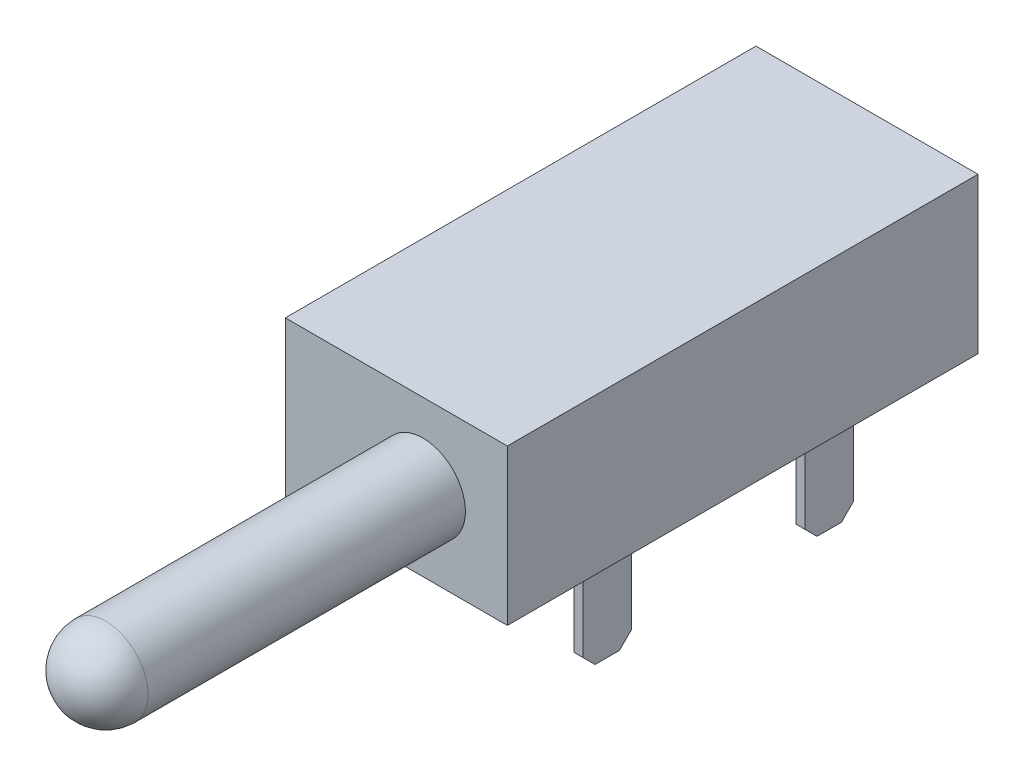
ISO-10303-21;
HEADER;
FILE_DESCRIPTION(('STEP AP214'),'2;1');
FILE_NAME('part.step','',(''),(''),'','','');
FILE_SCHEMA(('AUTOMOTIVE_DESIGN { 1 0 10303 214 1 1 1 1 }'));
ENDSEC;
DATA;
#1=APPLICATION_CONTEXT('core data for automotive mechanical design processes');
#2=APPLICATION_PROTOCOL_DEFINITION('international standard','automotive_design',2000,#1);
#3=PRODUCT_CONTEXT('',#1,'mechanical');
#4=PRODUCT('Part','Part','',(#3));
#5=PRODUCT_RELATED_PRODUCT_CATEGORY('part','',(#4));
#6=PRODUCT_DEFINITION_FORMATION('','',#4);
#7=PRODUCT_DEFINITION_CONTEXT('part definition',#1,'design');
#8=PRODUCT_DEFINITION('design','',#6,#7);
#9=PRODUCT_DEFINITION_SHAPE('','',#8);
#10=(LENGTH_UNIT() NAMED_UNIT(*) SI_UNIT(.MILLI.,.METRE.));
#11=(NAMED_UNIT(*) PLANE_ANGLE_UNIT() SI_UNIT($,.RADIAN.));
#12=(NAMED_UNIT(*) SI_UNIT($,.STERADIAN.) SOLID_ANGLE_UNIT());
#13=UNCERTAINTY_MEASURE_WITH_UNIT(LENGTH_MEASURE(1.E-05),#10,'distance_accuracy_value','');
#14=(GEOMETRIC_REPRESENTATION_CONTEXT(3) GLOBAL_UNCERTAINTY_ASSIGNED_CONTEXT((#13)) GLOBAL_UNIT_ASSIGNED_CONTEXT((#10,
#11,#12)) REPRESENTATION_CONTEXT('',''));
#15=CARTESIAN_POINT('',(0.,0.,0.));
#16=DIRECTION('',(0.,0.,1.));
#17=DIRECTION('',(1.,0.,0.));
#18=AXIS2_PLACEMENT_3D('',#15,#16,#17);
#19=CARTESIAN_POINT('',(-7.874,-4.445,-26.924));
#20=DIRECTION('',(0.,-1.,0.));
#21=DIRECTION('',(0.,0.,-1.));
#22=AXIS2_PLACEMENT_3D('',#19,#20,#21);
#23=PLANE('',#22);
#24=DIRECTION('',(1.,0.,0.));
#25=VECTOR('',#24,1.);
#26=CARTESIAN_POINT('',(-7.874,-4.445,0.));
#27=LINE('',#26,#25);
#28=CARTESIAN_POINT('',(-7.874,-4.445,0.));
#29=VERTEX_POINT('',#28);
#30=CARTESIAN_POINT('',(4.826,-4.445,0.));
#31=VERTEX_POINT('',#30);
#32=EDGE_CURVE('E278',#29,#31,#27,.T.);
#33=ORIENTED_EDGE('',*,*,#32,.F.);
#34=DIRECTION('',(0.,0.,1.));
#35=VECTOR('',#34,1.);
#36=CARTESIAN_POINT('',(-7.874,-4.445,-26.924));
#37=LINE('',#36,#35);
#38=CARTESIAN_POINT('',(-7.874,-4.445,-26.924));
#39=VERTEX_POINT('',#38);
#40=EDGE_CURVE('E286',#39,#29,#37,.T.);
#41=ORIENTED_EDGE('',*,*,#40,.F.);
#42=DIRECTION('',(1.,0.,0.));
#43=VECTOR('',#42,1.);
#44=CARTESIAN_POINT('',(-7.874,-4.445,-26.924));
#45=LINE('',#44,#43);
#46=CARTESIAN_POINT('',(4.826,-4.445,-26.924));
#47=VERTEX_POINT('',#46);
#48=EDGE_CURVE('E283',#39,#47,#45,.T.);
#49=ORIENTED_EDGE('',*,*,#48,.T.);
#50=DIRECTION('',(0.,0.,1.));
#51=VECTOR('',#50,1.);
#52=CARTESIAN_POINT('',(4.826,-4.445,-26.924));
#53=LINE('',#52,#51);
#54=EDGE_CURVE('E298',#47,#31,#53,.T.);
#55=ORIENTED_EDGE('',*,*,#54,.T.);
#56=EDGE_LOOP('',(#33,#41,#49,#55));
#57=FACE_BOUND('',#56,.T.);
#58=DIRECTION('',(1.,0.,0.));
#59=VECTOR('',#58,1.);
#60=CARTESIAN_POINT('',(-4.699,-4.445,-14.859));
#61=LINE('',#60,#59);
#62=CARTESIAN_POINT('',(-5.207,-4.445,-14.859));
#63=VERTEX_POINT('',#62);
#64=CARTESIAN_POINT('',(-4.699,-4.445,-14.859));
#65=VERTEX_POINT('',#64);
#66=EDGE_CURVE('E258',#63,#65,#61,.T.);
#67=ORIENTED_EDGE('',*,*,#66,.F.);
#68=DIRECTION('',(0.,0.,-1.));
#69=VECTOR('',#68,1.);
#70=CARTESIAN_POINT('',(-5.207,-4.445,-14.859));
#71=LINE('',#70,#69);
#72=CARTESIAN_POINT('',(-5.207,-4.445,-12.065));
#73=VERTEX_POINT('',#72);
#74=EDGE_CURVE('E247',#73,#63,#71,.T.);
#75=ORIENTED_EDGE('',*,*,#74,.F.);
#76=DIRECTION('',(-1.,0.,0.));
#77=VECTOR('',#76,1.);
#78=CARTESIAN_POINT('',(-4.699,-4.445,-12.065));
#79=LINE('',#78,#77);
#80=CARTESIAN_POINT('',(-4.699,-4.445,-12.065));
#81=VERTEX_POINT('',#80);
#82=EDGE_CURVE('E252',#81,#73,#79,.T.);
#83=ORIENTED_EDGE('',*,*,#82,.F.);
#84=DIRECTION('',(0.,0.,1.));
#85=VECTOR('',#84,1.);
#86=CARTESIAN_POINT('',(-4.699,-4.445,-14.859));
#87=LINE('',#86,#85);
#88=EDGE_CURVE('E261',#65,#81,#87,.T.);
#89=ORIENTED_EDGE('',*,*,#88,.F.);
#90=EDGE_LOOP('',(#67,#75,#83,#89));
#91=FACE_BOUND('',#90,.T.);
#92=DIRECTION('',(-1.,0.,0.));
#93=VECTOR('',#92,1.);
#94=CARTESIAN_POINT('',(1.651,-4.445,-19.685));
#95=LINE('',#94,#93);
#96=CARTESIAN_POINT('',(2.159,-4.445,-19.685));
#97=VERTEX_POINT('',#96);
#98=CARTESIAN_POINT('',(1.651,-4.445,-19.685));
#99=VERTEX_POINT('',#98);
#100=EDGE_CURVE('E232',#97,#99,#95,.T.);
#101=ORIENTED_EDGE('',*,*,#100,.F.);
#102=DIRECTION('',(0.,0.,1.));
#103=VECTOR('',#102,1.);
#104=CARTESIAN_POINT('',(2.159,-4.445,-19.685));
#105=LINE('',#104,#103);
#106=CARTESIAN_POINT('',(2.159,-4.445,-22.479));
#107=VERTEX_POINT('',#106);
#108=EDGE_CURVE('E195',#107,#97,#105,.T.);
#109=ORIENTED_EDGE('',*,*,#108,.F.);
#110=DIRECTION('',(1.,0.,0.));
#111=VECTOR('',#110,1.);
#112=CARTESIAN_POINT('',(1.651,-4.445,-22.479));
#113=LINE('',#112,#111);
#114=CARTESIAN_POINT('',(1.651,-4.445,-22.479));
#115=VERTEX_POINT('',#114);
#116=EDGE_CURVE('E226',#115,#107,#113,.T.);
#117=ORIENTED_EDGE('',*,*,#116,.F.);
#118=DIRECTION('',(0.,0.,-1.));
#119=VECTOR('',#118,1.);
#120=CARTESIAN_POINT('',(1.651,-4.445,-19.685));
#121=LINE('',#120,#119);
#122=EDGE_CURVE('E235',#99,#115,#121,.T.);
#123=ORIENTED_EDGE('',*,*,#122,.F.);
#124=EDGE_LOOP('',(#101,#109,#117,#123));
#125=FACE_BOUND('',#124,.T.);
#126=DIRECTION('',(1.,0.,0.));
#127=VECTOR('',#126,1.);
#128=CARTESIAN_POINT('',(2.159,-4.445,-9.779));
#129=LINE('',#128,#127);
#130=CARTESIAN_POINT('',(1.651,-4.445,-9.779));
#131=VERTEX_POINT('',#130);
#132=CARTESIAN_POINT('',(2.159,-4.445,-9.779));
#133=VERTEX_POINT('',#132);
#134=EDGE_CURVE('E189',#131,#133,#129,.T.);
#135=ORIENTED_EDGE('',*,*,#134,.F.);
#136=DIRECTION('',(0.,0.,-1.));
#137=VECTOR('',#136,1.);
#138=CARTESIAN_POINT('',(1.651,-4.445,-9.779));
#139=LINE('',#138,#137);
#140=CARTESIAN_POINT('',(1.651,-4.445,-6.985));
#141=VERTEX_POINT('',#140);
#142=EDGE_CURVE('E199',#141,#131,#139,.T.);
#143=ORIENTED_EDGE('',*,*,#142,.F.);
#144=DIRECTION('',(-1.,0.,0.));
#145=VECTOR('',#144,1.);
#146=CARTESIAN_POINT('',(2.159,-4.445,-6.985));
#147=LINE('',#146,#145);
#148=CARTESIAN_POINT('',(2.159,-4.445,-6.985));
#149=VERTEX_POINT('',#148);
#150=EDGE_CURVE('E211',#149,#141,#147,.T.);
#151=ORIENTED_EDGE('',*,*,#150,.F.);
#152=DIRECTION('',(0.,0.,1.));
#153=VECTOR('',#152,1.);
#154=CARTESIAN_POINT('',(2.159,-4.445,-9.779));
#155=LINE('',#154,#153);
#156=EDGE_CURVE('E209',#133,#149,#155,.T.);
#157=ORIENTED_EDGE('',*,*,#156,.F.);
#158=EDGE_LOOP('',(#135,#143,#151,#157));
#159=FACE_BOUND('',#158,.T.);
#160=ADVANCED_FACE('F35',(#57,#91,#125,#159),#23,.T.);
#161=CARTESIAN_POINT('',(-7.874,-4.445,-26.924));
#162=DIRECTION('',(1.,0.,0.));
#163=DIRECTION('',(0.,0.,-1.));
#164=AXIS2_PLACEMENT_3D('',#161,#162,#163);
#165=PLANE('',#164);
#166=DIRECTION('',(0.,1.,0.));
#167=VECTOR('',#166,1.);
#168=CARTESIAN_POINT('',(-7.874,-4.445,0.));
#169=LINE('',#168,#167);
#170=CARTESIAN_POINT('',(-7.874,4.445,0.));
#171=VERTEX_POINT('',#170);
#172=EDGE_CURVE('E273',#29,#171,#169,.T.);
#173=ORIENTED_EDGE('',*,*,#172,.T.);
#174=DIRECTION('',(0.,0.,1.));
#175=VECTOR('',#174,1.);
#176=CARTESIAN_POINT('',(-7.874,4.445,-26.924));
#177=LINE('',#176,#175);
#178=CARTESIAN_POINT('',(-7.874,4.445,-26.924));
#179=VERTEX_POINT('',#178);
#180=EDGE_CURVE('E302',#179,#171,#177,.T.);
#181=ORIENTED_EDGE('',*,*,#180,.F.);
#182=DIRECTION('',(0.,1.,0.));
#183=VECTOR('',#182,1.);
#184=CARTESIAN_POINT('',(-7.874,-4.445,-26.924));
#185=LINE('',#184,#183);
#186=EDGE_CURVE('E274',#39,#179,#185,.T.);
#187=ORIENTED_EDGE('',*,*,#186,.F.);
#188=ORIENTED_EDGE('',*,*,#40,.T.);
#189=EDGE_LOOP('',(#173,#181,#187,#188));
#190=FACE_BOUND('',#189,.T.);
#191=ADVANCED_FACE('F391',(#190),#165,.F.);
#192=CARTESIAN_POINT('',(-7.874,4.445,-26.924));
#193=DIRECTION('',(0.,-1.,0.));
#194=DIRECTION('',(0.,0.,-1.));
#195=AXIS2_PLACEMENT_3D('',#192,#193,#194);
#196=PLANE('',#195);
#197=DIRECTION('',(1.,0.,0.));
#198=VECTOR('',#197,1.);
#199=CARTESIAN_POINT('',(-7.874,4.445,0.));
#200=LINE('',#199,#198);
#201=CARTESIAN_POINT('',(4.826,4.445,0.));
#202=VERTEX_POINT('',#201);
#203=EDGE_CURVE('E289',#171,#202,#200,.T.);
#204=ORIENTED_EDGE('',*,*,#203,.T.);
#205=DIRECTION('',(0.,0.,1.));
#206=VECTOR('',#205,1.);
#207=CARTESIAN_POINT('',(4.826,4.445,-26.924));
#208=LINE('',#207,#206);
#209=CARTESIAN_POINT('',(4.826,4.445,-26.924));
#210=VERTEX_POINT('',#209);
#211=EDGE_CURVE('E300',#210,#202,#208,.T.);
#212=ORIENTED_EDGE('',*,*,#211,.F.);
#213=DIRECTION('',(1.,0.,0.));
#214=VECTOR('',#213,1.);
#215=CARTESIAN_POINT('',(-7.874,4.445,-26.924));
#216=LINE('',#215,#214);
#217=EDGE_CURVE('E277',#179,#210,#216,.T.);
#218=ORIENTED_EDGE('',*,*,#217,.F.);
#219=ORIENTED_EDGE('',*,*,#180,.T.);
#220=EDGE_LOOP('',(#204,#212,#218,#219));
#221=FACE_BOUND('',#220,.T.);
#222=ADVANCED_FACE('F397',(#221),#196,.F.);
#223=CARTESIAN_POINT('',(4.826,-4.445,-26.924));
#224=DIRECTION('',(1.,0.,0.));
#225=DIRECTION('',(0.,0.,-1.));
#226=AXIS2_PLACEMENT_3D('',#223,#224,#225);
#227=PLANE('',#226);
#228=DIRECTION('',(0.,1.,0.));
#229=VECTOR('',#228,1.);
#230=CARTESIAN_POINT('',(4.826,-4.445,0.));
#231=LINE('',#230,#229);
#232=EDGE_CURVE('E292',#31,#202,#231,.T.);
#233=ORIENTED_EDGE('',*,*,#232,.F.);
#234=ORIENTED_EDGE('',*,*,#54,.F.);
#235=DIRECTION('',(0.,1.,0.));
#236=VECTOR('',#235,1.);
#237=CARTESIAN_POINT('',(4.826,-4.445,-26.924));
#238=LINE('',#237,#236);
#239=EDGE_CURVE('E280',#47,#210,#238,.T.);
#240=ORIENTED_EDGE('',*,*,#239,.T.);
#241=ORIENTED_EDGE('',*,*,#211,.T.);
#242=EDGE_LOOP('',(#233,#234,#240,#241));
#243=FACE_BOUND('',#242,.T.);
#244=ADVANCED_FACE('F405',(#243),#227,.T.);
#245=CARTESIAN_POINT('',(0.,0.,-26.924));
#246=DIRECTION('',(0.,0.,-1.));
#247=DIRECTION('',(-1.,0.,0.));
#248=AXIS2_PLACEMENT_3D('',#245,#246,#247);
#249=PLANE('',#248);
#250=ORIENTED_EDGE('',*,*,#186,.T.);
#251=ORIENTED_EDGE('',*,*,#217,.T.);
#252=ORIENTED_EDGE('',*,*,#239,.F.);
#253=ORIENTED_EDGE('',*,*,#48,.F.);
#254=EDGE_LOOP('',(#250,#251,#252,#253));
#255=FACE_BOUND('',#254,.T.);
#256=ADVANCED_FACE('F408',(#255),#249,.T.);
#257=CARTESIAN_POINT('',(0.,0.,0.));
#258=DIRECTION('',(0.,0.,-1.));
#259=DIRECTION('',(-1.,0.,0.));
#260=AXIS2_PLACEMENT_3D('',#257,#258,#259);
#261=PLANE('',#260);
#262=CARTESIAN_POINT('',(0.,0.,0.));
#263=DIRECTION('',(0.,0.,-1.));
#264=DIRECTION('',(-1.,0.,0.));
#265=AXIS2_PLACEMENT_3D('',#262,#263,#264);
#266=CIRCLE('',#265,2.4257);
#267=CARTESIAN_POINT('',(-2.4257,0.,0.));
#268=VERTEX_POINT('',#267);
#269=EDGE_CURVE('E305',#268,#268,#266,.F.);
#270=ORIENTED_EDGE('',*,*,#269,.F.);
#271=EDGE_LOOP('',(#270));
#272=FACE_BOUND('',#271,.T.);
#273=ORIENTED_EDGE('',*,*,#172,.F.);
#274=ORIENTED_EDGE('',*,*,#32,.T.);
#275=ORIENTED_EDGE('',*,*,#232,.T.);
#276=ORIENTED_EDGE('',*,*,#203,.F.);
#277=EDGE_LOOP('',(#273,#274,#275,#276));
#278=FACE_BOUND('',#277,.T.);
#279=ADVANCED_FACE('F403',(#272,#278),#261,.F.);
#280=CARTESIAN_POINT('',(0.,0.,20.574));
#281=DIRECTION('',(0.,0.,-1.));
#282=DIRECTION('',(-1.,0.,0.));
#283=AXIS2_PLACEMENT_3D('',#280,#281,#282);
#284=CYLINDRICAL_SURFACE('',#283,2.4257);
#285=CARTESIAN_POINT('',(0.,0.,18.1483));
#286=DIRECTION('',(0.,0.,-1.));
#287=DIRECTION('',(-1.,0.,0.));
#288=AXIS2_PLACEMENT_3D('',#285,#286,#287);
#289=CIRCLE('',#288,2.4257);
#290=CARTESIAN_POINT('',(-2.4257,0.,18.1483));
#291=VERTEX_POINT('',#290);
#292=EDGE_CURVE('E308',#291,#291,#289,.T.);
#293=ORIENTED_EDGE('',*,*,#292,.T.);
#294=EDGE_LOOP('',(#293));
#295=FACE_BOUND('',#294,.T.);
#296=ORIENTED_EDGE('',*,*,#269,.T.);
#297=EDGE_LOOP('',(#296));
#298=FACE_BOUND('',#297,.T.);
#299=ADVANCED_FACE('F416',(#295,#298),#284,.T.);
#300=CARTESIAN_POINT('',(0.,0.,18.1483));
#301=DIRECTION('',(0.,0.,1.));
#302=DIRECTION('',(1.,0.,0.));
#303=AXIS2_PLACEMENT_3D('',#300,#301,#302);
#304=SPHERICAL_SURFACE('',#303,2.4257);
#305=ORIENTED_EDGE('',*,*,#292,.F.);
#306=EDGE_LOOP('',(#305));
#307=FACE_BOUND('',#306,.T.);
#308=ADVANCED_FACE('F413',(#307),#304,.T.);
#309=CARTESIAN_POINT('',(-5.207,-11.557,-14.859));
#310=DIRECTION('',(1.,0.,0.));
#311=DIRECTION('',(0.,0.,-1.));
#312=AXIS2_PLACEMENT_3D('',#309,#310,#311);
#313=PLANE('',#312);
#314=DIRECTION('',(0.,1.,0.));
#315=VECTOR('',#314,1.);
#316=CARTESIAN_POINT('',(-5.207,-11.557,-14.859));
#317=LINE('',#316,#315);
#318=CARTESIAN_POINT('',(-5.207,-10.8585,-14.859));
#319=VERTEX_POINT('',#318);
#320=EDGE_CURVE('E271',#319,#63,#317,.T.);
#321=ORIENTED_EDGE('',*,*,#320,.F.);
#322=DIRECTION('',(0.,-0.707106781186551,0.707106781186544));
#323=VECTOR('',#322,1.);
#324=CARTESIAN_POINT('',(-5.207,-11.557,-14.1605));
#325=LINE('',#324,#323);
#326=CARTESIAN_POINT('',(-5.207,-11.557,-14.1605));
#327=VERTEX_POINT('',#326);
#328=EDGE_CURVE('E43',#319,#327,#325,.T.);
#329=ORIENTED_EDGE('',*,*,#328,.T.);
#330=DIRECTION('',(0.,0.,-1.));
#331=VECTOR('',#330,1.);
#332=CARTESIAN_POINT('',(-5.207,-11.557,-14.859));
#333=LINE('',#332,#331);
#334=CARTESIAN_POINT('',(-5.207,-11.557,-12.7635));
#335=VERTEX_POINT('',#334);
#336=EDGE_CURVE('E248',#335,#327,#333,.T.);
#337=ORIENTED_EDGE('',*,*,#336,.F.);
#338=DIRECTION('',(0.,0.707106781186551,0.707106781186544));
#339=VECTOR('',#338,1.);
#340=CARTESIAN_POINT('',(-5.207,-11.557,-12.7635));
#341=LINE('',#340,#339);
#342=CARTESIAN_POINT('',(-5.207,-10.8585,-12.065));
#343=VERTEX_POINT('',#342);
#344=EDGE_CURVE('E50',#335,#343,#341,.T.);
#345=ORIENTED_EDGE('',*,*,#344,.T.);
#346=DIRECTION('',(0.,1.,0.));
#347=VECTOR('',#346,1.);
#348=CARTESIAN_POINT('',(-5.207,-11.557,-12.065));
#349=LINE('',#348,#347);
#350=EDGE_CURVE('E255',#343,#73,#349,.T.);
#351=ORIENTED_EDGE('',*,*,#350,.T.);
#352=ORIENTED_EDGE('',*,*,#74,.T.);
#353=EDGE_LOOP('',(#321,#329,#337,#345,#351,#352));
#354=FACE_BOUND('',#353,.T.);
#355=ADVANCED_FACE('F358',(#354),#313,.F.);
#356=CARTESIAN_POINT('',(-4.699,-11.557,-14.859));
#357=DIRECTION('',(0.,0.,1.));
#358=DIRECTION('',(1.,0.,0.));
#359=AXIS2_PLACEMENT_3D('',#356,#357,#358);
#360=PLANE('',#359);
#361=DIRECTION('',(0.,1.,0.));
#362=VECTOR('',#361,1.);
#363=CARTESIAN_POINT('',(-4.699,-11.557,-14.859));
#364=LINE('',#363,#362);
#365=CARTESIAN_POINT('',(-4.699,-10.8585,-14.859));
#366=VERTEX_POINT('',#365);
#367=EDGE_CURVE('E269',#366,#65,#364,.T.);
#368=ORIENTED_EDGE('',*,*,#367,.F.);
#369=DIRECTION('',(-1.,0.,0.));
#370=VECTOR('',#369,1.);
#371=CARTESIAN_POINT('',(-5.207,-10.8585,-14.859));
#372=LINE('',#371,#370);
#373=EDGE_CURVE('E58',#366,#319,#372,.T.);
#374=ORIENTED_EDGE('',*,*,#373,.T.);
#375=ORIENTED_EDGE('',*,*,#320,.T.);
#376=ORIENTED_EDGE('',*,*,#66,.T.);
#377=EDGE_LOOP('',(#368,#374,#375,#376));
#378=FACE_BOUND('',#377,.T.);
#379=ADVANCED_FACE('F368',(#378),#360,.F.);
#380=CARTESIAN_POINT('',(-4.699,-11.557,-14.859));
#381=DIRECTION('',(-1.,0.,0.));
#382=DIRECTION('',(0.,0.,1.));
#383=AXIS2_PLACEMENT_3D('',#380,#381,#382);
#384=PLANE('',#383);
#385=DIRECTION('',(0.,0.,1.));
#386=VECTOR('',#385,1.);
#387=CARTESIAN_POINT('',(-4.699,-11.557,-14.859));
#388=LINE('',#387,#386);
#389=CARTESIAN_POINT('',(-4.699,-11.557,-14.1605));
#390=VERTEX_POINT('',#389);
#391=CARTESIAN_POINT('',(-4.699,-11.557,-12.7635));
#392=VERTEX_POINT('',#391);
#393=EDGE_CURVE('E251',#390,#392,#388,.T.);
#394=ORIENTED_EDGE('',*,*,#393,.F.);
#395=DIRECTION('',(0.,0.707106781186551,-0.707106781186544));
#396=VECTOR('',#395,1.);
#397=CARTESIAN_POINT('',(-4.699,-11.557,-14.1605));
#398=LINE('',#397,#396);
#399=EDGE_CURVE('E354',#390,#366,#398,.T.);
#400=ORIENTED_EDGE('',*,*,#399,.T.);
#401=ORIENTED_EDGE('',*,*,#367,.T.);
#402=ORIENTED_EDGE('',*,*,#88,.T.);
#403=DIRECTION('',(0.,1.,0.));
#404=VECTOR('',#403,1.);
#405=CARTESIAN_POINT('',(-4.699,-11.557,-12.065));
#406=LINE('',#405,#404);
#407=CARTESIAN_POINT('',(-4.699,-10.8585,-12.065));
#408=VERTEX_POINT('',#407);
#409=EDGE_CURVE('E267',#408,#81,#406,.T.);
#410=ORIENTED_EDGE('',*,*,#409,.F.);
#411=DIRECTION('',(0.,-0.707106781186551,-0.707106781186544));
#412=VECTOR('',#411,1.);
#413=CARTESIAN_POINT('',(-4.699,-11.557,-12.7635));
#414=LINE('',#413,#412);
#415=EDGE_CURVE('E352',#408,#392,#414,.T.);
#416=ORIENTED_EDGE('',*,*,#415,.T.);
#417=EDGE_LOOP('',(#394,#400,#401,#402,#410,#416));
#418=FACE_BOUND('',#417,.T.);
#419=ADVANCED_FACE('F367',(#418),#384,.F.);
#420=CARTESIAN_POINT('',(-4.699,-11.557,-12.065));
#421=DIRECTION('',(0.,0.,-1.));
#422=DIRECTION('',(-1.,0.,0.));
#423=AXIS2_PLACEMENT_3D('',#420,#421,#422);
#424=PLANE('',#423);
#425=ORIENTED_EDGE('',*,*,#350,.F.);
#426=DIRECTION('',(1.,0.,0.));
#427=VECTOR('',#426,1.);
#428=CARTESIAN_POINT('',(-4.699,-10.8585,-12.065));
#429=LINE('',#428,#427);
#430=EDGE_CURVE('E11',#343,#408,#429,.T.);
#431=ORIENTED_EDGE('',*,*,#430,.T.);
#432=ORIENTED_EDGE('',*,*,#409,.T.);
#433=ORIENTED_EDGE('',*,*,#82,.T.);
#434=EDGE_LOOP('',(#425,#431,#432,#433));
#435=FACE_BOUND('',#434,.T.);
#436=ADVANCED_FACE('F380',(#435),#424,.F.);
#437=CARTESIAN_POINT('',(0.,-11.557,0.));
#438=DIRECTION('',(0.,-1.,0.));
#439=DIRECTION('',(0.,0.,-1.));
#440=AXIS2_PLACEMENT_3D('',#437,#438,#439);
#441=PLANE('',#440);
#442=ORIENTED_EDGE('',*,*,#336,.T.);
#443=DIRECTION('',(1.,0.,0.));
#444=VECTOR('',#443,1.);
#445=CARTESIAN_POINT('',(-4.699,-11.557,-14.1605));
#446=LINE('',#445,#444);
#447=EDGE_CURVE('E349',#327,#390,#446,.T.);
#448=ORIENTED_EDGE('',*,*,#447,.T.);
#449=ORIENTED_EDGE('',*,*,#393,.T.);
#450=DIRECTION('',(-1.,0.,0.));
#451=VECTOR('',#450,1.);
#452=CARTESIAN_POINT('',(-5.207,-11.557,-12.7635));
#453=LINE('',#452,#451);
#454=EDGE_CURVE('E346',#392,#335,#453,.T.);
#455=ORIENTED_EDGE('',*,*,#454,.T.);
#456=EDGE_LOOP('',(#442,#448,#449,#455));
#457=FACE_BOUND('',#456,.T.);
#458=ADVANCED_FACE('F362',(#457),#441,.T.);
#459=CARTESIAN_POINT('',(2.159,-11.557,-19.685));
#460=DIRECTION('',(-1.,0.,0.));
#461=DIRECTION('',(0.,0.,1.));
#462=AXIS2_PLACEMENT_3D('',#459,#460,#461);
#463=PLANE('',#462);
#464=DIRECTION('',(0.,0.,1.));
#465=VECTOR('',#464,1.);
#466=CARTESIAN_POINT('',(2.159,-11.557,-19.685));
#467=LINE('',#466,#465);
#468=CARTESIAN_POINT('',(2.159,-11.557,-21.7805));
#469=VERTEX_POINT('',#468);
#470=CARTESIAN_POINT('',(2.159,-11.557,-20.3835));
#471=VERTEX_POINT('',#470);
#472=EDGE_CURVE('E222',#469,#471,#467,.T.);
#473=ORIENTED_EDGE('',*,*,#472,.F.);
#474=DIRECTION('',(0.,0.707106781186548,-0.707106781186548));
#475=VECTOR('',#474,1.);
#476=CARTESIAN_POINT('',(2.159,-11.557,-21.7805));
#477=LINE('',#476,#475);
#478=CARTESIAN_POINT('',(2.159,-10.8585,-22.479));
#479=VERTEX_POINT('',#478);
#480=EDGE_CURVE('E336',#469,#479,#477,.T.);
#481=ORIENTED_EDGE('',*,*,#480,.T.);
#482=DIRECTION('',(0.,1.,0.));
#483=VECTOR('',#482,1.);
#484=CARTESIAN_POINT('',(2.159,-11.557,-22.479));
#485=LINE('',#484,#483);
#486=EDGE_CURVE('E229',#479,#107,#485,.T.);
#487=ORIENTED_EDGE('',*,*,#486,.T.);
#488=ORIENTED_EDGE('',*,*,#108,.T.);
#489=DIRECTION('',(0.,1.,0.));
#490=VECTOR('',#489,1.);
#491=CARTESIAN_POINT('',(2.159,-11.557,-19.685));
#492=LINE('',#491,#490);
#493=CARTESIAN_POINT('',(2.159,-10.8585,-19.685));
#494=VERTEX_POINT('',#493);
#495=EDGE_CURVE('E245',#494,#97,#492,.T.);
#496=ORIENTED_EDGE('',*,*,#495,.F.);
#497=DIRECTION('',(0.,-0.707106781186548,-0.707106781186548));
#498=VECTOR('',#497,1.);
#499=CARTESIAN_POINT('',(2.159,-11.557,-20.3835));
#500=LINE('',#499,#498);
#501=EDGE_CURVE('E334',#494,#471,#500,.T.);
#502=ORIENTED_EDGE('',*,*,#501,.T.);
#503=EDGE_LOOP('',(#473,#481,#487,#488,#496,#502));
#504=FACE_BOUND('',#503,.T.);
#505=ADVANCED_FACE('F387',(#504),#463,.F.);
#506=CARTESIAN_POINT('',(1.651,-11.557,-19.685));
#507=DIRECTION('',(0.,0.,-1.));
#508=DIRECTION('',(-1.,0.,0.));
#509=AXIS2_PLACEMENT_3D('',#506,#507,#508);
#510=PLANE('',#509);
#511=DIRECTION('',(0.,1.,0.));
#512=VECTOR('',#511,1.);
#513=CARTESIAN_POINT('',(1.651,-11.557,-19.685));
#514=LINE('',#513,#512);
#515=CARTESIAN_POINT('',(1.651,-10.8585,-19.685));
#516=VERTEX_POINT('',#515);
#517=EDGE_CURVE('E243',#516,#99,#514,.T.);
#518=ORIENTED_EDGE('',*,*,#517,.F.);
#519=DIRECTION('',(1.,0.,0.));
#520=VECTOR('',#519,1.);
#521=CARTESIAN_POINT('',(2.159,-10.8585,-19.685));
#522=LINE('',#521,#520);
#523=EDGE_CURVE('E344',#516,#494,#522,.T.);
#524=ORIENTED_EDGE('',*,*,#523,.T.);
#525=ORIENTED_EDGE('',*,*,#495,.T.);
#526=ORIENTED_EDGE('',*,*,#100,.T.);
#527=EDGE_LOOP('',(#518,#524,#525,#526));
#528=FACE_BOUND('',#527,.T.);
#529=ADVANCED_FACE('F543',(#528),#510,.F.);
#530=CARTESIAN_POINT('',(1.651,-11.557,-19.685));
#531=DIRECTION('',(1.,0.,0.));
#532=DIRECTION('',(0.,0.,-1.));
#533=AXIS2_PLACEMENT_3D('',#530,#531,#532);
#534=PLANE('',#533);
#535=DIRECTION('',(0.,1.,0.));
#536=VECTOR('',#535,1.);
#537=CARTESIAN_POINT('',(1.651,-11.557,-22.479));
#538=LINE('',#537,#536);
#539=CARTESIAN_POINT('',(1.651,-10.8585,-22.479));
#540=VERTEX_POINT('',#539);
#541=EDGE_CURVE('E241',#540,#115,#538,.T.);
#542=ORIENTED_EDGE('',*,*,#541,.F.);
#543=DIRECTION('',(0.,-0.707106781186548,0.707106781186548));
#544=VECTOR('',#543,1.);
#545=CARTESIAN_POINT('',(1.651,-11.557,-21.7805));
#546=LINE('',#545,#544);
#547=CARTESIAN_POINT('',(1.651,-11.557,-21.7805));
#548=VERTEX_POINT('',#547);
#549=EDGE_CURVE('E342',#540,#548,#546,.T.);
#550=ORIENTED_EDGE('',*,*,#549,.T.);
#551=DIRECTION('',(0.,0.,-1.));
#552=VECTOR('',#551,1.);
#553=CARTESIAN_POINT('',(1.651,-11.557,-19.685));
#554=LINE('',#553,#552);
#555=CARTESIAN_POINT('',(1.651,-11.557,-20.3835));
#556=VERTEX_POINT('',#555);
#557=EDGE_CURVE('E225',#556,#548,#554,.T.);
#558=ORIENTED_EDGE('',*,*,#557,.F.);
#559=DIRECTION('',(0.,0.707106781186548,0.707106781186548));
#560=VECTOR('',#559,1.);
#561=CARTESIAN_POINT('',(1.651,-11.557,-20.3835));
#562=LINE('',#561,#560);
#563=EDGE_CURVE('E340',#556,#516,#562,.T.);
#564=ORIENTED_EDGE('',*,*,#563,.T.);
#565=ORIENTED_EDGE('',*,*,#517,.T.);
#566=ORIENTED_EDGE('',*,*,#122,.T.);
#567=EDGE_LOOP('',(#542,#550,#558,#564,#565,#566));
#568=FACE_BOUND('',#567,.T.);
#569=ADVANCED_FACE('F533',(#568),#534,.F.);
#570=CARTESIAN_POINT('',(1.651,-11.557,-22.479));
#571=DIRECTION('',(0.,0.,1.));
#572=DIRECTION('',(1.,0.,0.));
#573=AXIS2_PLACEMENT_3D('',#570,#571,#572);
#574=PLANE('',#573);
#575=ORIENTED_EDGE('',*,*,#486,.F.);
#576=DIRECTION('',(-1.,0.,0.));
#577=VECTOR('',#576,1.);
#578=CARTESIAN_POINT('',(1.651,-10.8585,-22.479));
#579=LINE('',#578,#577);
#580=EDGE_CURVE('E338',#479,#540,#579,.T.);
#581=ORIENTED_EDGE('',*,*,#580,.T.);
#582=ORIENTED_EDGE('',*,*,#541,.T.);
#583=ORIENTED_EDGE('',*,*,#116,.T.);
#584=EDGE_LOOP('',(#575,#581,#582,#583));
#585=FACE_BOUND('',#584,.T.);
#586=ADVANCED_FACE('F523',(#585),#574,.F.);
#587=CARTESIAN_POINT('',(0.,-11.557,0.));
#588=DIRECTION('',(0.,-1.,0.));
#589=DIRECTION('',(0.,0.,-1.));
#590=AXIS2_PLACEMENT_3D('',#587,#588,#589);
#591=PLANE('',#590);
#592=ORIENTED_EDGE('',*,*,#557,.T.);
#593=DIRECTION('',(1.,0.,0.));
#594=VECTOR('',#593,1.);
#595=CARTESIAN_POINT('',(2.159,-11.557,-21.7805));
#596=LINE('',#595,#594);
#597=EDGE_CURVE('E331',#548,#469,#596,.T.);
#598=ORIENTED_EDGE('',*,*,#597,.T.);
#599=ORIENTED_EDGE('',*,*,#472,.T.);
#600=DIRECTION('',(-1.,0.,0.));
#601=VECTOR('',#600,1.);
#602=CARTESIAN_POINT('',(1.651,-11.557,-20.3835));
#603=LINE('',#602,#601);
#604=EDGE_CURVE('E328',#471,#556,#603,.T.);
#605=ORIENTED_EDGE('',*,*,#604,.T.);
#606=EDGE_LOOP('',(#592,#598,#599,#605));
#607=FACE_BOUND('',#606,.T.);
#608=ADVANCED_FACE('F514',(#607),#591,.T.);
#609=CARTESIAN_POINT('',(1.651,-11.557,-9.779));
#610=DIRECTION('',(1.,0.,0.));
#611=DIRECTION('',(0.,0.,-1.));
#612=AXIS2_PLACEMENT_3D('',#609,#610,#611);
#613=PLANE('',#612);
#614=DIRECTION('',(0.,0.,-1.));
#615=VECTOR('',#614,1.);
#616=CARTESIAN_POINT('',(1.651,-11.557,-9.779));
#617=LINE('',#616,#615);
#618=CARTESIAN_POINT('',(1.651,-11.557,-7.6835));
#619=VERTEX_POINT('',#618);
#620=CARTESIAN_POINT('',(1.651,-11.557,-9.0805));
#621=VERTEX_POINT('',#620);
#622=EDGE_CURVE('E216',#619,#621,#617,.T.);
#623=ORIENTED_EDGE('',*,*,#622,.F.);
#624=DIRECTION('',(0.,0.707106781186548,0.707106781186547));
#625=VECTOR('',#624,1.);
#626=CARTESIAN_POINT('',(1.651,-11.557,-7.6835));
#627=LINE('',#626,#625);
#628=CARTESIAN_POINT('',(1.651,-10.8585,-6.985));
#629=VERTEX_POINT('',#628);
#630=EDGE_CURVE('E319',#619,#629,#627,.T.);
#631=ORIENTED_EDGE('',*,*,#630,.T.);
#632=DIRECTION('',(0.,1.,0.));
#633=VECTOR('',#632,1.);
#634=CARTESIAN_POINT('',(1.651,-11.557,-6.985));
#635=LINE('',#634,#633);
#636=EDGE_CURVE('E203',#629,#141,#635,.T.);
#637=ORIENTED_EDGE('',*,*,#636,.T.);
#638=ORIENTED_EDGE('',*,*,#142,.T.);
#639=DIRECTION('',(0.,1.,0.));
#640=VECTOR('',#639,1.);
#641=CARTESIAN_POINT('',(1.651,-11.557,-9.779));
#642=LINE('',#641,#640);
#643=CARTESIAN_POINT('',(1.651,-10.8585,-9.779));
#644=VERTEX_POINT('',#643);
#645=EDGE_CURVE('E184',#644,#131,#642,.T.);
#646=ORIENTED_EDGE('',*,*,#645,.F.);
#647=DIRECTION('',(0.,-0.707106781186551,0.707106781186544));
#648=VECTOR('',#647,1.);
#649=CARTESIAN_POINT('',(1.651,-11.557,-9.0805));
#650=LINE('',#649,#648);
#651=EDGE_CURVE('E317',#644,#621,#650,.T.);
#652=ORIENTED_EDGE('',*,*,#651,.T.);
#653=EDGE_LOOP('',(#623,#631,#637,#638,#646,#652));
#654=FACE_BOUND('',#653,.T.);
#655=ADVANCED_FACE('F201',(#654),#613,.F.);
#656=CARTESIAN_POINT('',(2.159,-11.557,-9.779));
#657=DIRECTION('',(0.,0.,1.));
#658=DIRECTION('',(1.,0.,0.));
#659=AXIS2_PLACEMENT_3D('',#656,#657,#658);
#660=PLANE('',#659);
#661=DIRECTION('',(0.,1.,0.));
#662=VECTOR('',#661,1.);
#663=CARTESIAN_POINT('',(2.159,-11.557,-9.779));
#664=LINE('',#663,#662);
#665=CARTESIAN_POINT('',(2.159,-10.8585,-9.779));
#666=VERTEX_POINT('',#665);
#667=EDGE_CURVE('E196',#666,#133,#664,.T.);
#668=ORIENTED_EDGE('',*,*,#667,.F.);
#669=DIRECTION('',(-1.,0.,0.));
#670=VECTOR('',#669,1.);
#671=CARTESIAN_POINT('',(1.651,-10.8585,-9.779));
#672=LINE('',#671,#670);
#673=EDGE_CURVE('E192',#666,#644,#672,.T.);
#674=ORIENTED_EDGE('',*,*,#673,.T.);
#675=ORIENTED_EDGE('',*,*,#645,.T.);
#676=ORIENTED_EDGE('',*,*,#134,.T.);
#677=EDGE_LOOP('',(#668,#674,#675,#676));
#678=FACE_BOUND('',#677,.T.);
#679=ADVANCED_FACE('F187',(#678),#660,.F.);
#680=CARTESIAN_POINT('',(2.159,-11.557,-9.779));
#681=DIRECTION('',(-1.,0.,0.));
#682=DIRECTION('',(0.,0.,1.));
#683=AXIS2_PLACEMENT_3D('',#680,#681,#682);
#684=PLANE('',#683);
#685=DIRECTION('',(0.,1.,0.));
#686=VECTOR('',#685,1.);
#687=CARTESIAN_POINT('',(2.159,-11.557,-6.985));
#688=LINE('',#687,#686);
#689=CARTESIAN_POINT('',(2.159,-10.8585,-6.985));
#690=VERTEX_POINT('',#689);
#691=EDGE_CURVE('E218',#690,#149,#688,.T.);
#692=ORIENTED_EDGE('',*,*,#691,.F.);
#693=DIRECTION('',(0.,-0.707106781186548,-0.707106781186547));
#694=VECTOR('',#693,1.);
#695=CARTESIAN_POINT('',(2.159,-11.557,-7.6835));
#696=LINE('',#695,#694);
#697=CARTESIAN_POINT('',(2.159,-11.557,-7.6835));
#698=VERTEX_POINT('',#697);
#699=EDGE_CURVE('E325',#690,#698,#696,.T.);
#700=ORIENTED_EDGE('',*,*,#699,.T.);
#701=DIRECTION('',(0.,0.,1.));
#702=VECTOR('',#701,1.);
#703=CARTESIAN_POINT('',(2.159,-11.557,-9.779));
#704=LINE('',#703,#702);
#705=CARTESIAN_POINT('',(2.159,-11.557,-9.0805));
#706=VERTEX_POINT('',#705);
#707=EDGE_CURVE('E219',#706,#698,#704,.T.);
#708=ORIENTED_EDGE('',*,*,#707,.F.);
#709=DIRECTION('',(0.,0.707106781186551,-0.707106781186544));
#710=VECTOR('',#709,1.);
#711=CARTESIAN_POINT('',(2.159,-11.557,-9.0805));
#712=LINE('',#711,#710);
#713=EDGE_CURVE('E323',#706,#666,#712,.T.);
#714=ORIENTED_EDGE('',*,*,#713,.T.);
#715=ORIENTED_EDGE('',*,*,#667,.T.);
#716=ORIENTED_EDGE('',*,*,#156,.T.);
#717=EDGE_LOOP('',(#692,#700,#708,#714,#715,#716));
#718=FACE_BOUND('',#717,.T.);
#719=ADVANCED_FACE('F487',(#718),#684,.F.);
#720=CARTESIAN_POINT('',(2.159,-11.557,-6.985));
#721=DIRECTION('',(0.,0.,-1.));
#722=DIRECTION('',(-1.,0.,0.));
#723=AXIS2_PLACEMENT_3D('',#720,#721,#722);
#724=PLANE('',#723);
#725=ORIENTED_EDGE('',*,*,#636,.F.);
#726=DIRECTION('',(1.,0.,0.));
#727=VECTOR('',#726,1.);
#728=CARTESIAN_POINT('',(2.159,-10.8585,-6.985));
#729=LINE('',#728,#727);
#730=EDGE_CURVE('E321',#629,#690,#729,.T.);
#731=ORIENTED_EDGE('',*,*,#730,.T.);
#732=ORIENTED_EDGE('',*,*,#691,.T.);
#733=ORIENTED_EDGE('',*,*,#150,.T.);
#734=EDGE_LOOP('',(#725,#731,#732,#733));
#735=FACE_BOUND('',#734,.T.);
#736=ADVANCED_FACE('F477',(#735),#724,.F.);
#737=CARTESIAN_POINT('',(0.,-11.557,0.));
#738=DIRECTION('',(0.,-1.,0.));
#739=DIRECTION('',(0.,0.,-1.));
#740=AXIS2_PLACEMENT_3D('',#737,#738,#739);
#741=PLANE('',#740);
#742=ORIENTED_EDGE('',*,*,#707,.T.);
#743=DIRECTION('',(-1.,0.,0.));
#744=VECTOR('',#743,1.);
#745=CARTESIAN_POINT('',(1.651,-11.557,-7.6835));
#746=LINE('',#745,#744);
#747=EDGE_CURVE('E314',#698,#619,#746,.T.);
#748=ORIENTED_EDGE('',*,*,#747,.T.);
#749=ORIENTED_EDGE('',*,*,#622,.T.);
#750=DIRECTION('',(1.,0.,0.));
#751=VECTOR('',#750,1.);
#752=CARTESIAN_POINT('',(2.159,-11.557,-9.0805));
#753=LINE('',#752,#751);
#754=EDGE_CURVE('E311',#621,#706,#753,.T.);
#755=ORIENTED_EDGE('',*,*,#754,.T.);
#756=EDGE_LOOP('',(#742,#748,#749,#755));
#757=FACE_BOUND('',#756,.T.);
#758=ADVANCED_FACE('F422',(#757),#741,.T.);
#759=CARTESIAN_POINT('',(0.,-11.557,-7.6835));
#760=DIRECTION('',(0.,-0.707106781186547,0.707106781186548));
#761=DIRECTION('',(1.,0.,0.));
#762=AXIS2_PLACEMENT_3D('',#759,#760,#761);
#763=PLANE('',#762);
#764=ORIENTED_EDGE('',*,*,#699,.F.);
#765=ORIENTED_EDGE('',*,*,#730,.F.);
#766=ORIENTED_EDGE('',*,*,#630,.F.);
#767=ORIENTED_EDGE('',*,*,#747,.F.);
#768=EDGE_LOOP('',(#764,#765,#766,#767));
#769=FACE_BOUND('',#768,.T.);
#770=ADVANCED_FACE('F418',(#769),#763,.T.);
#771=CARTESIAN_POINT('',(0.,-11.557,-9.0805));
#772=DIRECTION('',(0.,-0.707106781186544,-0.707106781186551));
#773=DIRECTION('',(-1.,0.,0.));
#774=AXIS2_PLACEMENT_3D('',#771,#772,#773);
#775=PLANE('',#774);
#776=ORIENTED_EDGE('',*,*,#651,.F.);
#777=ORIENTED_EDGE('',*,*,#673,.F.);
#778=ORIENTED_EDGE('',*,*,#713,.F.);
#779=ORIENTED_EDGE('',*,*,#754,.F.);
#780=EDGE_LOOP('',(#776,#777,#778,#779));
#781=FACE_BOUND('',#780,.T.);
#782=ADVANCED_FACE('F421',(#781),#775,.T.);
#783=CARTESIAN_POINT('',(0.,-11.557,-21.7805));
#784=DIRECTION('',(0.,-0.707106781186547,-0.707106781186547));
#785=DIRECTION('',(-1.,0.,0.));
#786=AXIS2_PLACEMENT_3D('',#783,#784,#785);
#787=PLANE('',#786);
#788=ORIENTED_EDGE('',*,*,#549,.F.);
#789=ORIENTED_EDGE('',*,*,#580,.F.);
#790=ORIENTED_EDGE('',*,*,#480,.F.);
#791=ORIENTED_EDGE('',*,*,#597,.F.);
#792=EDGE_LOOP('',(#788,#789,#790,#791));
#793=FACE_BOUND('',#792,.T.);
#794=ADVANCED_FACE('F426',(#793),#787,.T.);
#795=CARTESIAN_POINT('',(0.,-11.557,-20.3835));
#796=DIRECTION('',(0.,-0.707106781186547,0.707106781186547));
#797=DIRECTION('',(1.,0.,0.));
#798=AXIS2_PLACEMENT_3D('',#795,#796,#797);
#799=PLANE('',#798);
#800=ORIENTED_EDGE('',*,*,#501,.F.);
#801=ORIENTED_EDGE('',*,*,#523,.F.);
#802=ORIENTED_EDGE('',*,*,#563,.F.);
#803=ORIENTED_EDGE('',*,*,#604,.F.);
#804=EDGE_LOOP('',(#800,#801,#802,#803));
#805=FACE_BOUND('',#804,.T.);
#806=ADVANCED_FACE('F430',(#805),#799,.T.);
#807=CARTESIAN_POINT('',(0.,-11.557,-14.1605));
#808=DIRECTION('',(0.,-0.707106781186544,-0.707106781186551));
#809=DIRECTION('',(-1.,0.,0.));
#810=AXIS2_PLACEMENT_3D('',#807,#808,#809);
#811=PLANE('',#810);
#812=ORIENTED_EDGE('',*,*,#328,.F.);
#813=ORIENTED_EDGE('',*,*,#373,.F.);
#814=ORIENTED_EDGE('',*,*,#399,.F.);
#815=ORIENTED_EDGE('',*,*,#447,.F.);
#816=EDGE_LOOP('',(#812,#813,#814,#815));
#817=FACE_BOUND('',#816,.T.);
#818=ADVANCED_FACE('F365',(#817),#811,.T.);
#819=CARTESIAN_POINT('',(0.,-11.557,-12.7635));
#820=DIRECTION('',(0.,-0.707106781186544,0.707106781186551));
#821=DIRECTION('',(1.,0.,0.));
#822=AXIS2_PLACEMENT_3D('',#819,#820,#821);
#823=PLANE('',#822);
#824=ORIENTED_EDGE('',*,*,#415,.F.);
#825=ORIENTED_EDGE('',*,*,#430,.F.);
#826=ORIENTED_EDGE('',*,*,#344,.F.);
#827=ORIENTED_EDGE('',*,*,#454,.F.);
#828=EDGE_LOOP('',(#824,#825,#826,#827));
#829=FACE_BOUND('',#828,.T.);
#830=ADVANCED_FACE('F37',(#829),#823,.T.);
#831=CLOSED_SHELL('',(#160,#191,#222,#244,#256,#279,#299,#308,#355,#379,#419,#436,#458,#505,
#529,#569,#586,#608,#655,#679,#719,#736,#758,#770,#782,#794,#806,#818,#830));
#832=MANIFOLD_SOLID_BREP('B2',#831);
#833=ADVANCED_BREP_SHAPE_REPRESENTATION('',(#18,#832),#14);
#834=SHAPE_DEFINITION_REPRESENTATION(#9,#833);
ENDSEC;
END-ISO-10303-21;
